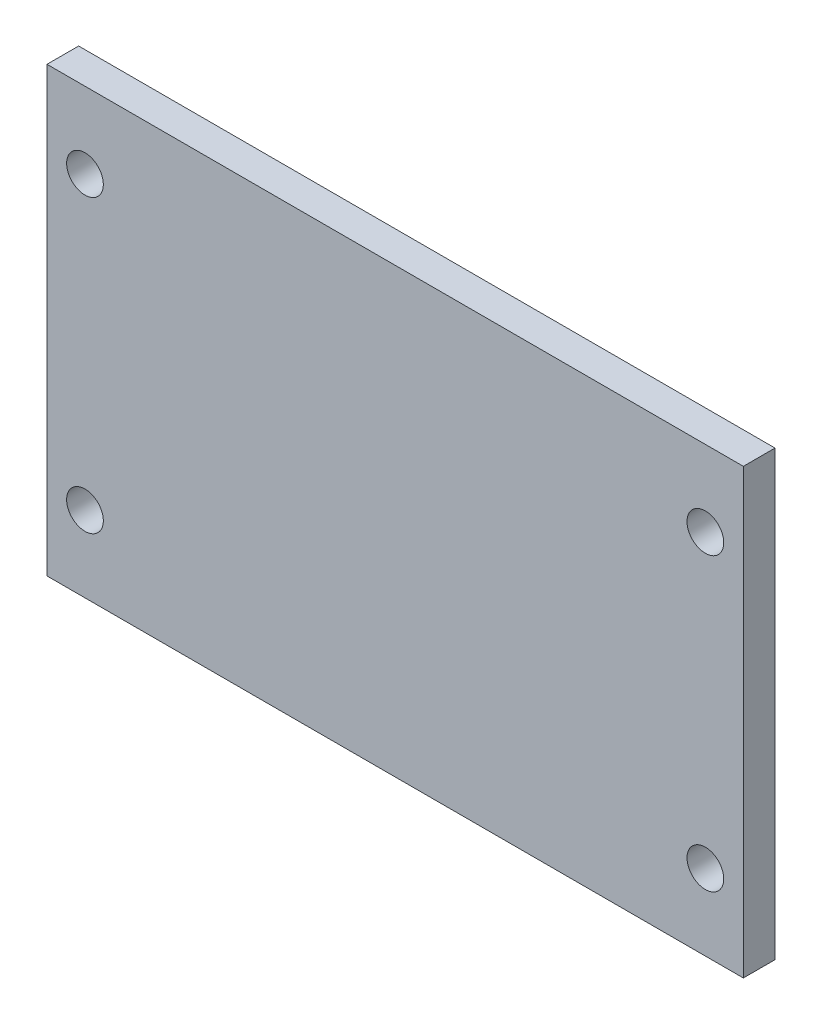
ISO-10303-21;
HEADER;
FILE_DESCRIPTION(('STEP AP214'),'2;1');
FILE_NAME('part.step','',(''),(''),'','','');
FILE_SCHEMA(('AUTOMOTIVE_DESIGN { 1 0 10303 214 1 1 1 1 }'));
ENDSEC;
DATA;
#1=APPLICATION_CONTEXT('core data for automotive mechanical design processes');
#2=APPLICATION_PROTOCOL_DEFINITION('international standard','automotive_design',2000,#1);
#3=PRODUCT_CONTEXT('',#1,'mechanical');
#4=PRODUCT('Part','Part','',(#3));
#5=PRODUCT_RELATED_PRODUCT_CATEGORY('part','',(#4));
#6=PRODUCT_DEFINITION_FORMATION('','',#4);
#7=PRODUCT_DEFINITION_CONTEXT('part definition',#1,'design');
#8=PRODUCT_DEFINITION('design','',#6,#7);
#9=PRODUCT_DEFINITION_SHAPE('','',#8);
#10=(LENGTH_UNIT() NAMED_UNIT(*) SI_UNIT(.MILLI.,.METRE.));
#11=(NAMED_UNIT(*) PLANE_ANGLE_UNIT() SI_UNIT($,.RADIAN.));
#12=(NAMED_UNIT(*) SI_UNIT($,.STERADIAN.) SOLID_ANGLE_UNIT());
#13=UNCERTAINTY_MEASURE_WITH_UNIT(LENGTH_MEASURE(1.E-05),#10,'distance_accuracy_value','');
#14=(GEOMETRIC_REPRESENTATION_CONTEXT(3) GLOBAL_UNCERTAINTY_ASSIGNED_CONTEXT((#13)) GLOBAL_UNIT_ASSIGNED_CONTEXT((#10,
#11,#12)) REPRESENTATION_CONTEXT('',''));
#15=CARTESIAN_POINT('',(0.,0.,0.));
#16=DIRECTION('',(0.,0.,1.));
#17=DIRECTION('',(1.,0.,0.));
#18=AXIS2_PLACEMENT_3D('',#15,#16,#17);
#19=CARTESIAN_POINT('',(-55.,35.,2.5));
#20=DIRECTION('',(1.,0.,0.));
#21=DIRECTION('',(0.,1.,0.));
#22=AXIS2_PLACEMENT_3D('',#19,#20,#21);
#23=PLANE('',#22);
#24=DIRECTION('',(0.,-1.,0.));
#25=VECTOR('',#24,1.);
#26=CARTESIAN_POINT('',(-55.,35.,-2.5));
#27=LINE('',#26,#25);
#28=CARTESIAN_POINT('',(-55.,35.,-2.5));
#29=VERTEX_POINT('',#28);
#30=CARTESIAN_POINT('',(-55.,-35.,-2.5));
#31=VERTEX_POINT('',#30);
#32=EDGE_CURVE('E99',#29,#31,#27,.T.);
#33=ORIENTED_EDGE('',*,*,#32,.T.);
#34=DIRECTION('',(0.,0.,-1.));
#35=VECTOR('',#34,1.);
#36=CARTESIAN_POINT('',(-55.,-35.,2.5));
#37=LINE('',#36,#35);
#38=CARTESIAN_POINT('',(-55.,-35.,2.5));
#39=VERTEX_POINT('',#38);
#40=EDGE_CURVE('E11',#39,#31,#37,.T.);
#41=ORIENTED_EDGE('',*,*,#40,.F.);
#42=DIRECTION('',(0.,-1.,0.));
#43=VECTOR('',#42,1.);
#44=CARTESIAN_POINT('',(-55.,35.,2.5));
#45=LINE('',#44,#43);
#46=CARTESIAN_POINT('',(-55.,35.,2.5));
#47=VERTEX_POINT('',#46);
#48=EDGE_CURVE('E87',#47,#39,#45,.T.);
#49=ORIENTED_EDGE('',*,*,#48,.F.);
#50=DIRECTION('',(0.,0.,-1.));
#51=VECTOR('',#50,1.);
#52=CARTESIAN_POINT('',(-55.,35.,2.5));
#53=LINE('',#52,#51);
#54=EDGE_CURVE('E95',#47,#29,#53,.T.);
#55=ORIENTED_EDGE('',*,*,#54,.T.);
#56=EDGE_LOOP('',(#33,#41,#49,#55));
#57=FACE_BOUND('',#56,.T.);
#58=ADVANCED_FACE('F36',(#57),#23,.F.);
#59=CARTESIAN_POINT('',(-55.,-35.,2.5));
#60=DIRECTION('',(0.,1.,0.));
#61=DIRECTION('',(0.,0.,1.));
#62=AXIS2_PLACEMENT_3D('',#59,#60,#61);
#63=PLANE('',#62);
#64=DIRECTION('',(1.,0.,0.));
#65=VECTOR('',#64,1.);
#66=CARTESIAN_POINT('',(-55.,-35.,-2.5));
#67=LINE('',#66,#65);
#68=CARTESIAN_POINT('',(55.,-35.,-2.5));
#69=VERTEX_POINT('',#68);
#70=EDGE_CURVE('E91',#31,#69,#67,.T.);
#71=ORIENTED_EDGE('',*,*,#70,.T.);
#72=DIRECTION('',(0.,0.,-1.));
#73=VECTOR('',#72,1.);
#74=CARTESIAN_POINT('',(55.,-35.,2.5));
#75=LINE('',#74,#73);
#76=CARTESIAN_POINT('',(55.,-35.,2.5));
#77=VERTEX_POINT('',#76);
#78=EDGE_CURVE('E44',#77,#69,#75,.T.);
#79=ORIENTED_EDGE('',*,*,#78,.F.);
#80=DIRECTION('',(1.,0.,0.));
#81=VECTOR('',#80,1.);
#82=CARTESIAN_POINT('',(-55.,-35.,2.5));
#83=LINE('',#82,#81);
#84=EDGE_CURVE('E82',#39,#77,#83,.T.);
#85=ORIENTED_EDGE('',*,*,#84,.F.);
#86=ORIENTED_EDGE('',*,*,#40,.T.);
#87=EDGE_LOOP('',(#71,#79,#85,#86));
#88=FACE_BOUND('',#87,.T.);
#89=ADVANCED_FACE('F90',(#88),#63,.F.);
#90=CARTESIAN_POINT('',(55.,35.,2.5));
#91=DIRECTION('',(-1.,0.,0.));
#92=DIRECTION('',(0.,-1.,0.));
#93=AXIS2_PLACEMENT_3D('',#90,#91,#92);
#94=PLANE('',#93);
#95=DIRECTION('',(0.,1.,0.));
#96=VECTOR('',#95,1.);
#97=CARTESIAN_POINT('',(55.,35.,-2.5));
#98=LINE('',#97,#96);
#99=CARTESIAN_POINT('',(55.,35.,-2.5));
#100=VERTEX_POINT('',#99);
#101=EDGE_CURVE('E69',#69,#100,#98,.T.);
#102=ORIENTED_EDGE('',*,*,#101,.T.);
#103=DIRECTION('',(0.,0.,-1.));
#104=VECTOR('',#103,1.);
#105=CARTESIAN_POINT('',(55.,35.,2.5));
#106=LINE('',#105,#104);
#107=CARTESIAN_POINT('',(55.,35.,2.5));
#108=VERTEX_POINT('',#107);
#109=EDGE_CURVE('E92',#108,#100,#106,.T.);
#110=ORIENTED_EDGE('',*,*,#109,.F.);
#111=DIRECTION('',(0.,1.,0.));
#112=VECTOR('',#111,1.);
#113=CARTESIAN_POINT('',(55.,35.,2.5));
#114=LINE('',#113,#112);
#115=EDGE_CURVE('E85',#77,#108,#114,.T.);
#116=ORIENTED_EDGE('',*,*,#115,.F.);
#117=ORIENTED_EDGE('',*,*,#78,.T.);
#118=EDGE_LOOP('',(#102,#110,#116,#117));
#119=FACE_BOUND('',#118,.T.);
#120=ADVANCED_FACE('F93',(#119),#94,.F.);
#121=CARTESIAN_POINT('',(-55.,35.,2.5));
#122=DIRECTION('',(0.,-1.,0.));
#123=DIRECTION('',(0.,0.,-1.));
#124=AXIS2_PLACEMENT_3D('',#121,#122,#123);
#125=PLANE('',#124);
#126=DIRECTION('',(-1.,0.,0.));
#127=VECTOR('',#126,1.);
#128=CARTESIAN_POINT('',(-55.,35.,-2.5));
#129=LINE('',#128,#127);
#130=EDGE_CURVE('E75',#100,#29,#129,.T.);
#131=ORIENTED_EDGE('',*,*,#130,.T.);
#132=ORIENTED_EDGE('',*,*,#54,.F.);
#133=DIRECTION('',(-1.,0.,0.));
#134=VECTOR('',#133,1.);
#135=CARTESIAN_POINT('',(-55.,35.,2.5));
#136=LINE('',#135,#134);
#137=EDGE_CURVE('E52',#108,#47,#136,.T.);
#138=ORIENTED_EDGE('',*,*,#137,.F.);
#139=ORIENTED_EDGE('',*,*,#109,.T.);
#140=EDGE_LOOP('',(#131,#132,#138,#139));
#141=FACE_BOUND('',#140,.T.);
#142=ADVANCED_FACE('F107',(#141),#125,.F.);
#143=CARTESIAN_POINT('',(0.,0.,2.5));
#144=DIRECTION('',(0.,0.,1.));
#145=DIRECTION('',(1.,0.,0.));
#146=AXIS2_PLACEMENT_3D('',#143,#144,#145);
#147=PLANE('',#146);
#148=CARTESIAN_POINT('',(-49.,23.,2.5));
#149=DIRECTION('',(0.,0.,1.));
#150=DIRECTION('',(1.,0.,0.));
#151=AXIS2_PLACEMENT_3D('',#148,#149,#150);
#152=CIRCLE('',#151,2.9);
#153=CARTESIAN_POINT('',(-46.1,23.,2.5));
#154=VERTEX_POINT('',#153);
#155=EDGE_CURVE('E133',#154,#154,#152,.T.);
#156=ORIENTED_EDGE('',*,*,#155,.F.);
#157=EDGE_LOOP('',(#156));
#158=FACE_BOUND('',#157,.T.);
#159=CARTESIAN_POINT('',(-49.,-23.,2.5));
#160=DIRECTION('',(0.,0.,1.));
#161=DIRECTION('',(1.,0.,0.));
#162=AXIS2_PLACEMENT_3D('',#159,#160,#161);
#163=CIRCLE('',#162,2.9);
#164=CARTESIAN_POINT('',(-46.1,-23.,2.5));
#165=VERTEX_POINT('',#164);
#166=EDGE_CURVE('E127',#165,#165,#163,.T.);
#167=ORIENTED_EDGE('',*,*,#166,.F.);
#168=EDGE_LOOP('',(#167));
#169=FACE_BOUND('',#168,.T.);
#170=CARTESIAN_POINT('',(49.,-23.,2.5));
#171=DIRECTION('',(0.,0.,1.));
#172=DIRECTION('',(1.,0.,0.));
#173=AXIS2_PLACEMENT_3D('',#170,#171,#172);
#174=CIRCLE('',#173,2.9);
#175=CARTESIAN_POINT('',(51.9,-23.,2.5));
#176=VERTEX_POINT('',#175);
#177=EDGE_CURVE('E121',#176,#176,#174,.T.);
#178=ORIENTED_EDGE('',*,*,#177,.F.);
#179=EDGE_LOOP('',(#178));
#180=FACE_BOUND('',#179,.T.);
#181=CARTESIAN_POINT('',(49.,23.,2.5));
#182=DIRECTION('',(0.,0.,1.));
#183=DIRECTION('',(1.,0.,0.));
#184=AXIS2_PLACEMENT_3D('',#181,#182,#183);
#185=CIRCLE('',#184,2.9);
#186=CARTESIAN_POINT('',(51.9,23.,2.5));
#187=VERTEX_POINT('',#186);
#188=EDGE_CURVE('E115',#187,#187,#185,.T.);
#189=ORIENTED_EDGE('',*,*,#188,.F.);
#190=EDGE_LOOP('',(#189));
#191=FACE_BOUND('',#190,.T.);
#192=ORIENTED_EDGE('',*,*,#48,.T.);
#193=ORIENTED_EDGE('',*,*,#84,.T.);
#194=ORIENTED_EDGE('',*,*,#115,.T.);
#195=ORIENTED_EDGE('',*,*,#137,.T.);
#196=EDGE_LOOP('',(#192,#193,#194,#195));
#197=FACE_BOUND('',#196,.T.);
#198=ADVANCED_FACE('F83',(#158,#169,#180,#191,#197),#147,.T.);
#199=CARTESIAN_POINT('',(0.,0.,-2.5));
#200=DIRECTION('',(0.,0.,1.));
#201=DIRECTION('',(1.,0.,0.));
#202=AXIS2_PLACEMENT_3D('',#199,#200,#201);
#203=PLANE('',#202);
#204=CARTESIAN_POINT('',(-49.,23.,-2.5));
#205=DIRECTION('',(0.,0.,1.));
#206=DIRECTION('',(1.,0.,0.));
#207=AXIS2_PLACEMENT_3D('',#204,#205,#206);
#208=CIRCLE('',#207,2.89999999999999);
#209=CARTESIAN_POINT('',(-46.1,23.,-2.5));
#210=VERTEX_POINT('',#209);
#211=EDGE_CURVE('E130',#210,#210,#208,.T.);
#212=ORIENTED_EDGE('',*,*,#211,.T.);
#213=EDGE_LOOP('',(#212));
#214=FACE_BOUND('',#213,.T.);
#215=CARTESIAN_POINT('',(-49.,-23.,-2.5));
#216=DIRECTION('',(0.,0.,1.));
#217=DIRECTION('',(1.,0.,0.));
#218=AXIS2_PLACEMENT_3D('',#215,#216,#217);
#219=CIRCLE('',#218,2.89999999999999);
#220=CARTESIAN_POINT('',(-46.1,-23.,-2.5));
#221=VERTEX_POINT('',#220);
#222=EDGE_CURVE('E124',#221,#221,#219,.T.);
#223=ORIENTED_EDGE('',*,*,#222,.T.);
#224=EDGE_LOOP('',(#223));
#225=FACE_BOUND('',#224,.T.);
#226=CARTESIAN_POINT('',(49.,-23.,-2.5));
#227=DIRECTION('',(0.,0.,1.));
#228=DIRECTION('',(1.,0.,0.));
#229=AXIS2_PLACEMENT_3D('',#226,#227,#228);
#230=CIRCLE('',#229,2.89999999999999);
#231=CARTESIAN_POINT('',(51.9,-23.,-2.5));
#232=VERTEX_POINT('',#231);
#233=EDGE_CURVE('E118',#232,#232,#230,.T.);
#234=ORIENTED_EDGE('',*,*,#233,.T.);
#235=EDGE_LOOP('',(#234));
#236=FACE_BOUND('',#235,.T.);
#237=CARTESIAN_POINT('',(49.,23.,-2.5));
#238=DIRECTION('',(0.,0.,1.));
#239=DIRECTION('',(1.,0.,0.));
#240=AXIS2_PLACEMENT_3D('',#237,#238,#239);
#241=CIRCLE('',#240,2.89999999999999);
#242=CARTESIAN_POINT('',(51.9,23.,-2.5));
#243=VERTEX_POINT('',#242);
#244=EDGE_CURVE('E102',#243,#243,#241,.T.);
#245=ORIENTED_EDGE('',*,*,#244,.T.);
#246=EDGE_LOOP('',(#245));
#247=FACE_BOUND('',#246,.T.);
#248=ORIENTED_EDGE('',*,*,#32,.F.);
#249=ORIENTED_EDGE('',*,*,#130,.F.);
#250=ORIENTED_EDGE('',*,*,#101,.F.);
#251=ORIENTED_EDGE('',*,*,#70,.F.);
#252=EDGE_LOOP('',(#248,#249,#250,#251));
#253=FACE_BOUND('',#252,.T.);
#254=ADVANCED_FACE('F110',(#214,#225,#236,#247,#253),#203,.F.);
#255=CARTESIAN_POINT('',(49.,23.,2.5));
#256=DIRECTION('',(0.,0.,1.));
#257=DIRECTION('',(1.,0.,0.));
#258=AXIS2_PLACEMENT_3D('',#255,#256,#257);
#259=CYLINDRICAL_SURFACE('',#258,2.89999999999999);
#260=ORIENTED_EDGE('',*,*,#244,.F.);
#261=EDGE_LOOP('',(#260));
#262=FACE_BOUND('',#261,.T.);
#263=ORIENTED_EDGE('',*,*,#188,.T.);
#264=EDGE_LOOP('',(#263));
#265=FACE_BOUND('',#264,.T.);
#266=ADVANCED_FACE('F148',(#262,#265),#259,.F.);
#267=CARTESIAN_POINT('',(49.,-23.,2.5));
#268=DIRECTION('',(0.,0.,1.));
#269=DIRECTION('',(1.,0.,0.));
#270=AXIS2_PLACEMENT_3D('',#267,#268,#269);
#271=CYLINDRICAL_SURFACE('',#270,2.89999999999999);
#272=ORIENTED_EDGE('',*,*,#233,.F.);
#273=EDGE_LOOP('',(#272));
#274=FACE_BOUND('',#273,.T.);
#275=ORIENTED_EDGE('',*,*,#177,.T.);
#276=EDGE_LOOP('',(#275));
#277=FACE_BOUND('',#276,.T.);
#278=ADVANCED_FACE('F150',(#274,#277),#271,.F.);
#279=CARTESIAN_POINT('',(-49.,-23.,2.5));
#280=DIRECTION('',(0.,0.,1.));
#281=DIRECTION('',(1.,0.,0.));
#282=AXIS2_PLACEMENT_3D('',#279,#280,#281);
#283=CYLINDRICAL_SURFACE('',#282,2.89999999999999);
#284=ORIENTED_EDGE('',*,*,#222,.F.);
#285=EDGE_LOOP('',(#284));
#286=FACE_BOUND('',#285,.T.);
#287=ORIENTED_EDGE('',*,*,#166,.T.);
#288=EDGE_LOOP('',(#287));
#289=FACE_BOUND('',#288,.T.);
#290=ADVANCED_FACE('F157',(#286,#289),#283,.F.);
#291=CARTESIAN_POINT('',(-49.,23.,2.5));
#292=DIRECTION('',(0.,0.,1.));
#293=DIRECTION('',(1.,0.,0.));
#294=AXIS2_PLACEMENT_3D('',#291,#292,#293);
#295=CYLINDRICAL_SURFACE('',#294,2.89999999999999);
#296=ORIENTED_EDGE('',*,*,#211,.F.);
#297=EDGE_LOOP('',(#296));
#298=FACE_BOUND('',#297,.T.);
#299=ORIENTED_EDGE('',*,*,#155,.T.);
#300=EDGE_LOOP('',(#299));
#301=FACE_BOUND('',#300,.T.);
#302=ADVANCED_FACE('F137',(#298,#301),#295,.F.);
#303=CLOSED_SHELL('',(#58,#89,#120,#142,#198,#254,#266,#278,#290,#302));
#304=MANIFOLD_SOLID_BREP('B2',#303);
#305=ADVANCED_BREP_SHAPE_REPRESENTATION('',(#18,#304),#14);
#306=SHAPE_DEFINITION_REPRESENTATION(#9,#305);
ENDSEC;
END-ISO-10303-21;
